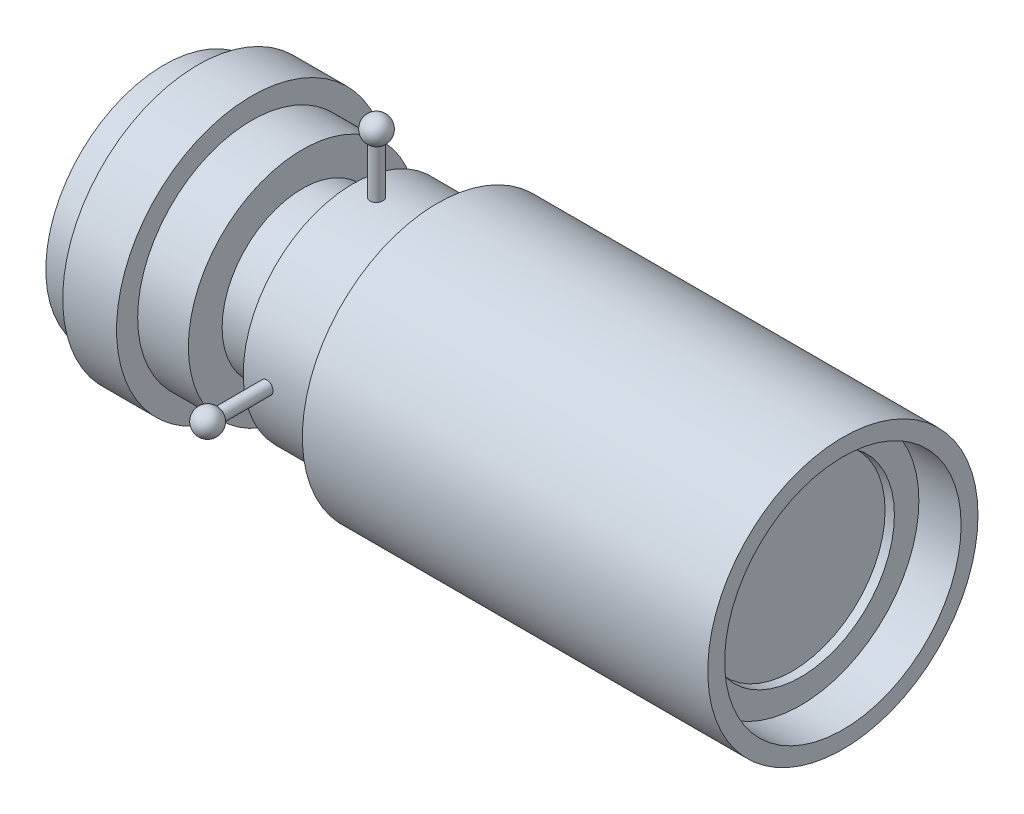
ISO-10303-21;
HEADER;
FILE_DESCRIPTION(('STEP AP214'),'2;1');
FILE_NAME('part.step','',(''),(''),'','','');
FILE_SCHEMA(('AUTOMOTIVE_DESIGN { 1 0 10303 214 1 1 1 1 }'));
ENDSEC;
DATA;
#1=APPLICATION_CONTEXT('core data for automotive mechanical design processes');
#2=APPLICATION_PROTOCOL_DEFINITION('international standard','automotive_design',2000,#1);
#3=PRODUCT_CONTEXT('',#1,'mechanical');
#4=PRODUCT('Part','Part','',(#3));
#5=PRODUCT_RELATED_PRODUCT_CATEGORY('part','',(#4));
#6=PRODUCT_DEFINITION_FORMATION('','',#4);
#7=PRODUCT_DEFINITION_CONTEXT('part definition',#1,'design');
#8=PRODUCT_DEFINITION('design','',#6,#7);
#9=PRODUCT_DEFINITION_SHAPE('','',#8);
#10=(LENGTH_UNIT() NAMED_UNIT(*) SI_UNIT(.MILLI.,.METRE.));
#11=(NAMED_UNIT(*) PLANE_ANGLE_UNIT() SI_UNIT($,.RADIAN.));
#12=(NAMED_UNIT(*) SI_UNIT($,.STERADIAN.) SOLID_ANGLE_UNIT());
#13=UNCERTAINTY_MEASURE_WITH_UNIT(LENGTH_MEASURE(1.E-05),#10,'distance_accuracy_value','');
#14=(GEOMETRIC_REPRESENTATION_CONTEXT(3) GLOBAL_UNCERTAINTY_ASSIGNED_CONTEXT((#13)) GLOBAL_UNIT_ASSIGNED_CONTEXT((#10,
#11,#12)) REPRESENTATION_CONTEXT('',''));
#15=CARTESIAN_POINT('',(0.,0.,0.));
#16=DIRECTION('',(0.,0.,1.));
#17=DIRECTION('',(1.,0.,0.));
#18=AXIS2_PLACEMENT_3D('',#15,#16,#17);
#19=CARTESIAN_POINT('',(-78.0171483417485,59.1215627402625,107.583431876308));
#20=DIRECTION('',(-1.,0.,0.));
#21=DIRECTION('',(0.,0.,1.));
#22=AXIS2_PLACEMENT_3D('',#19,#20,#21);
#23=PLANE('',#22);
#24=CARTESIAN_POINT('',(-78.0171483417485,59.1215627402625,107.583431876308));
#25=DIRECTION('',(1.,0.,0.));
#26=DIRECTION('',(0.,0.,-1.));
#27=AXIS2_PLACEMENT_3D('',#24,#25,#26);
#28=CIRCLE('',#27,44.45);
#29=CARTESIAN_POINT('',(-78.0171483417485,59.1215627402625,63.1334318763079));
#30=VERTEX_POINT('',#29);
#31=EDGE_CURVE('E47',#30,#30,#28,.T.);
#32=ORIENTED_EDGE('',*,*,#31,.F.);
#33=EDGE_LOOP('',(#32));
#34=FACE_BOUND('',#33,.T.);
#35=CARTESIAN_POINT('',(-78.0171483417485,59.1215627402625,107.583431876308));
#36=DIRECTION('',(1.,0.,0.));
#37=DIRECTION('',(0.,0.,-1.));
#38=AXIS2_PLACEMENT_3D('',#35,#36,#37);
#39=CIRCLE('',#38,32.5501);
#40=CARTESIAN_POINT('',(-78.0171483417485,59.1215627402625,75.0333318763079));
#41=VERTEX_POINT('',#40);
#42=EDGE_CURVE('E278',#41,#41,#39,.T.);
#43=ORIENTED_EDGE('',*,*,#42,.T.);
#44=EDGE_LOOP('',(#43));
#45=FACE_BOUND('',#44,.T.);
#46=ADVANCED_FACE('F13',(#34,#45),#23,.T.);
#47=CARTESIAN_POINT('',(177.170301658252,109.921562740263,107.583431876308));
#48=DIRECTION('',(1.,0.,0.));
#49=DIRECTION('',(0.,0.,-1.));
#50=AXIS2_PLACEMENT_3D('',#47,#48,#49);
#51=PLANE('',#50);
#52=CARTESIAN_POINT('',(177.170301658252,59.1215627402625,107.583431876308));
#53=DIRECTION('',(1.,0.,0.));
#54=DIRECTION('',(0.,0.,-1.));
#55=AXIS2_PLACEMENT_3D('',#52,#53,#54);
#56=CIRCLE('',#55,50.8);
#57=CARTESIAN_POINT('',(177.170301658252,59.1215627402625,56.7834318763079));
#58=VERTEX_POINT('',#57);
#59=EDGE_CURVE('E29',#58,#58,#56,.T.);
#60=ORIENTED_EDGE('',*,*,#59,.T.);
#61=EDGE_LOOP('',(#60));
#62=FACE_BOUND('',#61,.T.);
#63=CARTESIAN_POINT('',(177.170301658252,59.1215627402625,107.583431876308));
#64=DIRECTION('',(1.,0.,0.));
#65=DIRECTION('',(0.,0.,-1.));
#66=AXIS2_PLACEMENT_3D('',#63,#64,#65);
#67=CIRCLE('',#66,44.45);
#68=CARTESIAN_POINT('',(177.170301658252,59.1215627402625,63.1334318763079));
#69=VERTEX_POINT('',#68);
#70=EDGE_CURVE('E200',#69,#69,#67,.T.);
#71=ORIENTED_EDGE('',*,*,#70,.F.);
#72=EDGE_LOOP('',(#71));
#73=FACE_BOUND('',#72,.T.);
#74=ADVANCED_FACE('F15',(#62,#73),#51,.T.);
#75=CARTESIAN_POINT('',(24.7703016582515,94.3767627402625,107.583431876308));
#76=DIRECTION('',(-1.,0.,0.));
#77=DIRECTION('',(0.,0.,1.));
#78=AXIS2_PLACEMENT_3D('',#75,#76,#77);
#79=PLANE('',#78);
#80=CARTESIAN_POINT('',(24.7703016582515,59.1215627402625,107.583431876308));
#81=DIRECTION('',(1.,0.,0.));
#82=DIRECTION('',(0.,0.,-1.));
#83=AXIS2_PLACEMENT_3D('',#80,#81,#82);
#84=CIRCLE('',#83,50.8);
#85=CARTESIAN_POINT('',(24.7703016582515,59.1215627402625,56.7834318763079));
#86=VERTEX_POINT('',#85);
#87=EDGE_CURVE('E22',#86,#86,#84,.T.);
#88=ORIENTED_EDGE('',*,*,#87,.F.);
#89=EDGE_LOOP('',(#88));
#90=FACE_BOUND('',#89,.T.);
#91=CARTESIAN_POINT('',(24.7703016582515,59.1215627402625,107.583431876308));
#92=DIRECTION('',(-1.,0.,0.));
#93=DIRECTION('',(0.,0.,1.));
#94=AXIS2_PLACEMENT_3D('',#91,#92,#93);
#95=CIRCLE('',#94,41.275);
#96=CARTESIAN_POINT('',(24.7703016582515,59.1215627402625,148.858431876308));
#97=VERTEX_POINT('',#96);
#98=EDGE_CURVE('E242',#97,#97,#95,.T.);
#99=ORIENTED_EDGE('',*,*,#98,.F.);
#100=EDGE_LOOP('',(#99));
#101=FACE_BOUND('',#100,.T.);
#102=ADVANCED_FACE('F147',(#90,#101),#79,.T.);
#103=CARTESIAN_POINT('',(177.170301658252,59.1215627402625,107.583431876308));
#104=DIRECTION('',(1.,0.,0.));
#105=DIRECTION('',(0.,0.,-1.));
#106=AXIS2_PLACEMENT_3D('',#103,#104,#105);
#107=CYLINDRICAL_SURFACE('',#106,50.8);
#108=ORIENTED_EDGE('',*,*,#87,.T.);
#109=EDGE_LOOP('',(#108));
#110=FACE_BOUND('',#109,.T.);
#111=ORIENTED_EDGE('',*,*,#59,.F.);
#112=EDGE_LOOP('',(#111));
#113=FACE_BOUND('',#112,.T.);
#114=ADVANCED_FACE('F137',(#110,#113),#107,.T.);
#115=CARTESIAN_POINT('',(-45.0796983417485,59.1215627402625,107.583431876308));
#116=DIRECTION('',(-1.,0.,0.));
#117=DIRECTION('',(0.,0.,1.));
#118=AXIS2_PLACEMENT_3D('',#115,#116,#117);
#119=CYLINDRICAL_SURFACE('',#118,41.275);
#120=CARTESIAN_POINT('',(4.23289890072671,100.396562740263,107.583431876307));
#121=CARTESIAN_POINT('',(4.23289299780843,100.396561819881,107.717424198853));
#122=CARTESIAN_POINT('',(4.22158151443307,100.395903283161,107.85151082114));
#123=CARTESIAN_POINT('',(4.17661934903501,100.393339559722,108.115983008283));
#124=CARTESIAN_POINT('',(4.14294253875862,100.39143291494,108.246364058113));
#125=CARTESIAN_POINT('',(4.05421900539376,100.386588710888,108.499555832176));
#126=CARTESIAN_POINT('',(3.99918340308884,100.383651688177,108.622370457488));
#127=CARTESIAN_POINT('',(3.86932220294319,100.377077238978,108.856985763426));
#128=CARTESIAN_POINT('',(3.79450119281907,100.37343997491,108.96878898907));
#129=CARTESIAN_POINT('',(3.62708563944906,100.365868715182,109.178386142113));
#130=CARTESIAN_POINT('',(3.53447081559785,100.361934384073,109.276163859595));
#131=CARTESIAN_POINT('',(3.33413801652064,100.354215286754,109.454795981656));
#132=CARTESIAN_POINT('',(3.22641941619124,100.350430526742,109.535649685453));
#133=CARTESIAN_POINT('',(2.99884715056514,100.343434857868,109.678186923284));
#134=CARTESIAN_POINT('',(2.87898519838171,100.340224345073,109.739857247744));
#135=CARTESIAN_POINT('',(2.63058684805583,100.334743479808,109.842192541279));
#136=CARTESIAN_POINT('',(2.50205053225712,100.332473118415,109.882857709718));
#137=CARTESIAN_POINT('',(2.24010608885022,100.329131727286,109.941984049703));
#138=CARTESIAN_POINT('',(2.10670363005134,100.328059345312,109.960470257842));
#139=CARTESIAN_POINT('',(1.83868509780719,100.327230791935,109.974791194611));
#140=CARTESIAN_POINT('',(1.70406903645938,100.327474607425,109.970626148785));
#141=CARTESIAN_POINT('',(1.43761498352795,100.329249698096,109.939783611391));
#142=CARTESIAN_POINT('',(1.30577384617899,100.330779424863,109.913133195155));
#143=CARTESIAN_POINT('',(1.04843961837524,100.334951499081,109.838118405809));
#144=CARTESIAN_POINT('',(0.922946561504216,100.337593852419,109.789753917837));
#145=CARTESIAN_POINT('',(0.681783696174177,100.343695171115,109.672653064286));
#146=CARTESIAN_POINT('',(0.566119876472209,100.347154629537,109.603904391916));
#147=CARTESIAN_POINT('',(0.347964238935068,100.354499780539,109.447995627094));
#148=CARTESIAN_POINT('',(0.24547254725768,100.358385477202,109.360835358325));
#149=CARTESIAN_POINT('',(0.0564129773318895,100.366152065514,109.170424949797));
#150=CARTESIAN_POINT('',(-0.0301312983034777,100.370032941731,109.067151372493));
#151=CARTESIAN_POINT('',(-0.184657377509493,100.377347026096,108.847528149635));
#152=CARTESIAN_POINT('',(-0.25263917542123,100.380780234108,108.731178500097));
#153=CARTESIAN_POINT('',(-0.368108443093572,100.386812310973,108.488691757557));
#154=CARTESIAN_POINT('',(-0.415595046896915,100.389411144571,108.362554251268));
#155=CARTESIAN_POINT('',(-0.488710324764417,100.393481116171,108.104078661509));
#156=CARTESIAN_POINT('',(-0.514339217589914,100.394952265459,107.971740640111));
#157=CARTESIAN_POINT('',(-0.542982379367461,100.396599630025,107.704825440864));
#158=CARTESIAN_POINT('',(-0.546029286692625,100.396777714198,107.57025177652));
#159=CARTESIAN_POINT('',(-0.529507224691486,100.39582384733,107.302505274379));
#160=CARTESIAN_POINT('',(-0.509938355952366,100.394691902116,107.169332430354));
#161=CARTESIAN_POINT('',(-0.448767250375907,100.391246633961,106.908259606731));
#162=CARTESIAN_POINT('',(-0.407179959451332,100.388934112422,106.780356113742));
#163=CARTESIAN_POINT('',(-0.30316768825478,100.383387933989,106.533344345062));
#164=CARTESIAN_POINT('',(-0.240742547304242,100.380154269992,106.414236137198));
#165=CARTESIAN_POINT('',(-0.0967433206178364,100.373124664792,106.188046359921));
#166=CARTESIAN_POINT('',(-0.0151474044639895,100.369328084409,106.080978708567));
#167=CARTESIAN_POINT('',(0.164845341297011,100.361602172478,105.88204934465));
#168=CARTESIAN_POINT('',(0.263242313299683,100.357672839803,105.790187760979));
#169=CARTESIAN_POINT('',(0.474184695077236,100.350118908938,105.624167852857));
#170=CARTESIAN_POINT('',(0.586746766865326,100.346494678148,105.550030679919));
#171=CARTESIAN_POINT('',(0.822740207874764,100.339965472831,105.421708707882));
#172=CARTESIAN_POINT('',(0.946171517881797,100.337060494384,105.367523800093));
#173=CARTESIAN_POINT('',(1.20032197656275,100.332300027223,105.280681198396));
#174=CARTESIAN_POINT('',(1.33103654033861,100.330443886271,105.248010123676));
#175=CARTESIAN_POINT('',(1.59610687349027,100.327988592356,105.205078874241));
#176=CARTESIAN_POINT('',(1.73046261289071,100.327389429048,105.194818515091));
#177=CARTESIAN_POINT('',(1.99879104024656,100.327515908479,105.197001698125));
#178=CARTESIAN_POINT('',(2.13276400100456,100.328239610415,105.209411979736));
#179=CARTESIAN_POINT('',(2.39672065711518,100.330926154407,105.256515283018));
#180=CARTESIAN_POINT('',(2.52670434507817,100.332888998759,105.291208345962));
#181=CARTESIAN_POINT('',(2.77899840824806,100.337832158006,105.381885159474));
#182=CARTESIAN_POINT('',(2.90130878876675,100.340812472197,105.437868895303));
#183=CARTESIAN_POINT('',(3.13479783885741,100.347454627737,105.569532946636));
#184=CARTESIAN_POINT('',(3.24597681779542,100.351116450137,105.645212714533));
#185=CARTESIAN_POINT('',(3.45421500874772,100.358715167345,105.814242390613));
#186=CARTESIAN_POINT('',(3.55125489870756,100.362652427889,105.907616085498));
#187=CARTESIAN_POINT('',(3.72831453461654,100.370355355403,106.10935597607));
#188=CARTESIAN_POINT('',(3.80833010147093,100.374120980061,106.217725842236));
#189=CARTESIAN_POINT('',(3.94912003962222,100.381059697684,106.446489887237));
#190=CARTESIAN_POINT('',(4.00987265678993,100.384232119082,106.56689746022));
#191=CARTESIAN_POINT('',(4.11022577613303,100.389617585143,106.816133546145));
#192=CARTESIAN_POINT('',(4.14985113521927,100.391831756637,106.944951962177));
#193=CARTESIAN_POINT('',(4.19648815920124,100.394468845125,107.1593748122));
#194=CARTESIAN_POINT('',(4.21012462081479,100.395250581644,107.243592075818));
#195=CARTESIAN_POINT('',(4.22833186371869,100.39629782164,107.413004133736));
#196=CARTESIAN_POINT('',(4.23290265559211,100.39656332572,107.498198926896));
#197=CARTESIAN_POINT('',(4.23289890072671,100.396562740263,107.583431876307));
#198=B_SPLINE_CURVE_WITH_KNOTS('',3,(#120,#121,#122,#123,#124,#125,#126,#127,#128,#129,#130,
#131,#132,#133,#134,#135,#136,#137,#138,#139,#140,#141,#142,#143,#144,#145,#146,#147,#148,#149,
#150,#151,#152,#153,#154,#155,#156,#157,#158,#159,#160,#161,#162,#163,#164,#165,#166,#167,#168,
#169,#170,#171,#172,#173,#174,#175,#176,#177,#178,#179,#180,#181,#182,#183,#184,#185,#186,#187,
#188,#189,#190,#191,#192,#193,#194,#195,#196,#197),.UNSPECIFIED.,.T.,.F.,(4,2,2,2,2,2,2,2,2,2,2,
2,2,2,2,2,2,2,2,2,2,2,2,2,2,2,2,2,2,2,2,2,2,2,2,2,2,2,4),(0.,0.401665824304537,
0.803801721395143,1.20572852054412,1.60756220501651,2.00985662831124,2.41216770637324,
2.814755203592,3.21733887967799,3.61946767255596,4.02159246134957,4.42323372914227,
4.8248771215474,5.2267634984674,5.62865372422012,6.03113406311283,6.43361452470456,
6.83611199012489,7.23860542713083,7.64051701549831,8.04242681630834,8.4440641533606,
8.84570458746943,9.24780461917807,9.64990805901092,10.0524889821852,10.4550677122823,
10.8573958161251,11.2597206088744,11.6614556164529,12.0631913681494,12.4649268417439,
12.8666511471279,13.2689193889994,13.6712862651844,14.0741059390714,14.4764506307366,
14.7319518579585,14.9874527869134),.UNSPECIFIED.);
#199=CARTESIAN_POINT('',(4.23289890072671,100.396562740263,107.583431876307));
#200=VERTEX_POINT('',#199);
#201=EDGE_CURVE('E52',#200,#200,#198,.T.);
#202=ORIENTED_EDGE('',*,*,#201,.T.);
#203=EDGE_LOOP('',(#202));
#204=FACE_BOUND('',#203,.T.);
#205=CARTESIAN_POINT('',(4.23289890072671,59.1215627402625,148.858431876308));
#206=CARTESIAN_POINT('',(4.23289299780843,58.9875704177169,148.858430955926));
#207=CARTESIAN_POINT('',(4.22158151443307,58.8534837954303,148.857772419207));
#208=CARTESIAN_POINT('',(4.17661934903501,58.5890116082874,148.855208695767));
#209=CARTESIAN_POINT('',(4.14294253875862,58.4586305584566,148.853302050985));
#210=CARTESIAN_POINT('',(4.05421900539376,58.2054387843936,148.848457846933));
#211=CARTESIAN_POINT('',(3.99918340308884,58.0826241590823,148.845520824222));
#212=CARTESIAN_POINT('',(3.86932220294319,57.848008853144,148.838946375023));
#213=CARTESIAN_POINT('',(3.79450119281907,57.7362056275,148.835309110956));
#214=CARTESIAN_POINT('',(3.62708563944906,57.5266084744569,148.827737851228));
#215=CARTESIAN_POINT('',(3.53447081559785,57.4288307569753,148.823803520119));
#216=CARTESIAN_POINT('',(3.33413801652064,57.2501986349136,148.816084422799));
#217=CARTESIAN_POINT('',(3.22641941619123,57.1693449311168,148.812299662788));
#218=CARTESIAN_POINT('',(2.99884715056514,57.0268076932859,148.805303993914));
#219=CARTESIAN_POINT('',(2.87898519838171,56.9651373688258,148.802093481119));
#220=CARTESIAN_POINT('',(2.63058684805583,56.8628020752914,148.796612615854));
#221=CARTESIAN_POINT('',(2.50205053225712,56.8221369068516,148.794342254461));
#222=CARTESIAN_POINT('',(2.24010608885022,56.7630105668672,148.791000863331));
#223=CARTESIAN_POINT('',(2.10670363005134,56.7445243587276,148.789928481357));
#224=CARTESIAN_POINT('',(1.83868509780719,56.7302034219586,148.78909992798));
#225=CARTESIAN_POINT('',(1.70406903645938,56.7343684677853,148.789343743471));
#226=CARTESIAN_POINT('',(1.43761498352795,56.765211005179,148.791118834142));
#227=CARTESIAN_POINT('',(1.30577384617899,56.7918614214149,148.792648560908));
#228=CARTESIAN_POINT('',(1.04843961837524,56.8668762107608,148.796820635126));
#229=CARTESIAN_POINT('',(0.922946561504217,56.9152406987331,148.799462988464));
#230=CARTESIAN_POINT('',(0.681783696174176,57.0323415522844,148.80556430716));
#231=CARTESIAN_POINT('',(0.566119876472208,57.1010902246544,148.809023765582));
#232=CARTESIAN_POINT('',(0.347964238935067,57.2569989894755,148.816368916585));
#233=CARTESIAN_POINT('',(0.245472547257681,57.3441592582449,148.820254613247));
#234=CARTESIAN_POINT('',(0.0564129773318909,57.5345696667726,148.828021201559));
#235=CARTESIAN_POINT('',(-0.0301312983034765,57.6378432440773,148.831902077776));
#236=CARTESIAN_POINT('',(-0.184657377509492,57.8574664669346,148.839216162141));
#237=CARTESIAN_POINT('',(-0.252639175421228,57.9738161164734,148.842649370153));
#238=CARTESIAN_POINT('',(-0.368108443093571,58.2163028590131,148.848681447018));
#239=CARTESIAN_POINT('',(-0.415595046896915,58.3424403653023,148.851280280616));
#240=CARTESIAN_POINT('',(-0.488710324764419,58.6009159550608,148.855350252217));
#241=CARTESIAN_POINT('',(-0.514339217589914,58.7332539764587,148.856821401505));
#242=CARTESIAN_POINT('',(-0.54298237936746,59.0001691757062,148.85846876607));
#243=CARTESIAN_POINT('',(-0.546029286692624,59.1347428400497,148.858646850243));
#244=CARTESIAN_POINT('',(-0.529507224691484,59.4024893421908,148.857692983376));
#245=CARTESIAN_POINT('',(-0.509938355952365,59.5356621862161,148.856561038162));
#246=CARTESIAN_POINT('',(-0.448767250375909,59.7967350098392,148.853115770006));
#247=CARTESIAN_POINT('',(-0.407179959451335,59.9246385028277,148.850803248468));
#248=CARTESIAN_POINT('',(-0.303167688254783,60.1716502715081,148.845257070035));
#249=CARTESIAN_POINT('',(-0.240742547304242,60.2907584793717,148.842023406037));
#250=CARTESIAN_POINT('',(-0.0967433206178337,60.5169482566489,148.834993800837));
#251=CARTESIAN_POINT('',(-0.0151474044639862,60.6240159080034,148.831197220455));
#252=CARTESIAN_POINT('',(0.164845341297016,60.8229452719195,148.823471308523));
#253=CARTESIAN_POINT('',(0.263242313299688,60.9148068555907,148.819541975849));
#254=CARTESIAN_POINT('',(0.474184695077237,61.080826763713,148.811988044983));
#255=CARTESIAN_POINT('',(0.586746766865325,61.1549639366506,148.808363814194));
#256=CARTESIAN_POINT('',(0.822740207874762,61.2832859086882,148.801834608876));
#257=CARTESIAN_POINT('',(0.946171517881796,61.3374708164774,148.798929630429));
#258=CARTESIAN_POINT('',(1.20032197656275,61.4243134181739,148.794169163268));
#259=CARTESIAN_POINT('',(1.33103654033861,61.4569844928939,148.792313022317));
#260=CARTESIAN_POINT('',(1.59610687349028,61.4999157423286,148.789857728402));
#261=CARTESIAN_POINT('',(1.73046261289071,61.5101761014791,148.789258565093));
#262=CARTESIAN_POINT('',(1.99879104024656,61.5079929184452,148.789385044524));
#263=CARTESIAN_POINT('',(2.13276400100456,61.4955826368343,148.79010874646));
#264=CARTESIAN_POINT('',(2.39672065711518,61.4484793335524,148.792795290453));
#265=CARTESIAN_POINT('',(2.52670434507817,61.4137862706082,148.794758134804));
#266=CARTESIAN_POINT('',(2.77899840824806,61.3231094570964,148.799701294051));
#267=CARTESIAN_POINT('',(2.90130878876675,61.2671257212673,148.802681608242));
#268=CARTESIAN_POINT('',(3.13479783885741,61.1354616699342,148.809323763782));
#269=CARTESIAN_POINT('',(3.24597681779542,61.0597819020366,148.812985586183));
#270=CARTESIAN_POINT('',(3.45421500874772,60.8907522259569,148.820584303391));
#271=CARTESIAN_POINT('',(3.55125489870756,60.7973785310724,148.824521563935));
#272=CARTESIAN_POINT('',(3.72831453461653,60.5956386405002,148.832224491448));
#273=CARTESIAN_POINT('',(3.80833010147093,60.4872687743342,148.835990116107));
#274=CARTESIAN_POINT('',(3.94912003962222,60.2585047293329,148.842928833729));
#275=CARTESIAN_POINT('',(4.00987265678992,60.13809715635,148.846101255128));
#276=CARTESIAN_POINT('',(4.11022577613302,59.8888610704253,148.851486721188));
#277=CARTESIAN_POINT('',(4.14985113521926,59.7600426543928,148.853700892682));
#278=CARTESIAN_POINT('',(4.19648815920124,59.5456198043699,148.85633798117));
#279=CARTESIAN_POINT('',(4.21012462081479,59.4614025407523,148.85711971769));
#280=CARTESIAN_POINT('',(4.22833186371869,59.2919904828337,148.858166957686));
#281=CARTESIAN_POINT('',(4.23290265559211,59.2067956896739,148.858432461766));
#282=CARTESIAN_POINT('',(4.23289890072671,59.1215627402625,148.858431876308));
#283=B_SPLINE_CURVE_WITH_KNOTS('',3,(#205,#206,#207,#208,#209,#210,#211,#212,#213,#214,#215,
#216,#217,#218,#219,#220,#221,#222,#223,#224,#225,#226,#227,#228,#229,#230,#231,#232,#233,#234,
#235,#236,#237,#238,#239,#240,#241,#242,#243,#244,#245,#246,#247,#248,#249,#250,#251,#252,#253,
#254,#255,#256,#257,#258,#259,#260,#261,#262,#263,#264,#265,#266,#267,#268,#269,#270,#271,#272,
#273,#274,#275,#276,#277,#278,#279,#280,#281,#282),.UNSPECIFIED.,.T.,.F.,(4,2,2,2,2,2,2,2,2,2,2,
2,2,2,2,2,2,2,2,2,2,2,2,2,2,2,2,2,2,2,2,2,2,2,2,2,2,2,4),(0.,0.401665824304551,
0.803801721395143,1.20572852054413,1.60756220501652,2.00985662831124,2.41216770637324,
2.81475520359201,3.21733887967799,3.61946767255597,4.02159246134957,4.42323372914227,
4.8248771215474,5.2267634984674,5.62865372422012,6.03113406311282,6.43361452470457,
6.83611199012488,7.23860542713085,7.64051701549833,8.04242681630835,8.44406415336059,
8.84570458746943,9.24780461917809,9.64990805901092,10.0524889821852,10.4550677122823,
10.8573958161251,11.2597206088744,11.6614556164529,12.0631913681494,12.4649268417439,
12.8666511471279,13.2689193889994,13.6712862651844,14.0741059390713,14.4764506307366,
14.7319518579585,14.9874527869134),.UNSPECIFIED.);
#284=CARTESIAN_POINT('',(4.23289890072671,59.1215627402625,148.858431876308));
#285=VERTEX_POINT('',#284);
#286=EDGE_CURVE('E62',#285,#285,#283,.T.);
#287=ORIENTED_EDGE('',*,*,#286,.T.);
#288=EDGE_LOOP('',(#287));
#289=FACE_BOUND('',#288,.T.);
#290=CARTESIAN_POINT('',(4.23289890072671,17.8465627402625,107.583431876308));
#291=CARTESIAN_POINT('',(4.23289299780843,17.8465636606441,107.449439553762));
#292=CARTESIAN_POINT('',(4.22158151443307,17.8472221973637,107.315352931476));
#293=CARTESIAN_POINT('',(4.17661934903501,17.8497859208029,107.050880744333));
#294=CARTESIAN_POINT('',(4.14294253875862,17.8516925655853,106.920499694502));
#295=CARTESIAN_POINT('',(4.05421900539376,17.8565367696371,106.667307920439));
#296=CARTESIAN_POINT('',(3.99918340308884,17.8594737923482,106.544493295128));
#297=CARTESIAN_POINT('',(3.86932220294319,17.8660482415473,106.30987798919));
#298=CARTESIAN_POINT('',(3.79450119281908,17.8696855056146,106.198074763546));
#299=CARTESIAN_POINT('',(3.62708563944906,17.8772567653428,105.988477610502));
#300=CARTESIAN_POINT('',(3.53447081559785,17.8811910964516,105.890699893021));
#301=CARTESIAN_POINT('',(3.33413801652064,17.8889101937709,105.712067770959));
#302=CARTESIAN_POINT('',(3.22641941619124,17.8926949537827,105.631214067162));
#303=CARTESIAN_POINT('',(2.99884715056514,17.8996906226567,105.488676829331));
#304=CARTESIAN_POINT('',(2.8789851983817,17.9029011354517,105.427006504871));
#305=CARTESIAN_POINT('',(2.63058684805583,17.9083820007166,105.324671211337));
#306=CARTESIAN_POINT('',(2.50205053225712,17.9106523621098,105.284006042897));
#307=CARTESIAN_POINT('',(2.24010608885022,17.913993753239,105.224879702913));
#308=CARTESIAN_POINT('',(2.10670363005134,17.915066135213,105.206393494773));
#309=CARTESIAN_POINT('',(1.83868509780719,17.9158946885904,105.192072558004));
#310=CARTESIAN_POINT('',(1.70406903645938,17.9156508730996,105.196237603831));
#311=CARTESIAN_POINT('',(1.43761498352795,17.9138757824287,105.227080141225));
#312=CARTESIAN_POINT('',(1.30577384617899,17.9123460556624,105.25373055746));
#313=CARTESIAN_POINT('',(1.04843961837524,17.9081739814439,105.328745346806));
#314=CARTESIAN_POINT('',(0.922946561504217,17.9055316281062,105.377109834779));
#315=CARTESIAN_POINT('',(0.681783696174175,17.89943030941,105.49421068833));
#316=CARTESIAN_POINT('',(0.566119876472204,17.8959708509881,105.5629593607));
#317=CARTESIAN_POINT('',(0.347964238935064,17.8886256999857,105.718868125521));
#318=CARTESIAN_POINT('',(0.245472547257679,17.8847400033235,105.80602839429));
#319=CARTESIAN_POINT('',(0.0564129773318934,17.876973415011,105.996438802818));
#320=CARTESIAN_POINT('',(-0.0301312983034722,17.873092538794,106.099712380123));
#321=CARTESIAN_POINT('',(-0.184657377509489,17.8657784544289,106.31933560298));
#322=CARTESIAN_POINT('',(-0.252639175421228,17.8623452464174,106.435685252519));
#323=CARTESIAN_POINT('',(-0.368108443093572,17.8563131695525,106.678171995059));
#324=CARTESIAN_POINT('',(-0.415595046896915,17.853714335954,106.804309501348));
#325=CARTESIAN_POINT('',(-0.488710324764417,17.8496443643539,107.062785091106));
#326=CARTESIAN_POINT('',(-0.514339217589914,17.8481732150658,107.195123112504));
#327=CARTESIAN_POINT('',(-0.54298237936746,17.8465258505002,107.462038311752));
#328=CARTESIAN_POINT('',(-0.546029286692624,17.8463477663273,107.596611976095));
#329=CARTESIAN_POINT('',(-0.529507224691486,17.8473016331947,107.864358478236));
#330=CARTESIAN_POINT('',(-0.509938355952366,17.8484335784087,107.997531322262));
#331=CARTESIAN_POINT('',(-0.448767250375909,17.851878846564,108.258604145885));
#332=CARTESIAN_POINT('',(-0.407179959451336,17.8541913681026,108.386507638873));
#333=CARTESIAN_POINT('',(-0.303167688254785,17.8597375465359,108.633519407554));
#334=CARTESIAN_POINT('',(-0.240742547304244,17.8629712105334,108.752627615417));
#335=CARTESIAN_POINT('',(-0.0967433206178346,17.8700008157332,108.978817392694));
#336=CARTESIAN_POINT('',(-0.015147404463987,17.8737973961156,109.085885044049));
#337=CARTESIAN_POINT('',(0.164845341297015,17.8815233080473,109.284814407965));
#338=CARTESIAN_POINT('',(0.263242313299687,17.8854526407216,109.376675991636));
#339=CARTESIAN_POINT('',(0.474184695077239,17.8930065715871,109.542695899759));
#340=CARTESIAN_POINT('',(0.586746766865329,17.8966308023765,109.616833072696));
#341=CARTESIAN_POINT('',(0.822740207874765,17.9031600076944,109.745155044734));
#342=CARTESIAN_POINT('',(0.946171517881797,17.9060649861409,109.799339952523));
#343=CARTESIAN_POINT('',(1.20032197656275,17.9108254533025,109.886182554219));
#344=CARTESIAN_POINT('',(1.33103654033861,17.9126815942538,109.918853628939));
#345=CARTESIAN_POINT('',(1.59610687349028,17.9151368881687,109.961784878374));
#346=CARTESIAN_POINT('',(1.73046261289071,17.915736051477,109.972045237525));
#347=CARTESIAN_POINT('',(1.99879104024655,17.9156095720465,109.969862054491));
#348=CARTESIAN_POINT('',(2.13276400100456,17.9148858701101,109.95745177288));
#349=CARTESIAN_POINT('',(2.39672065711518,17.9121993261176,109.910348469598));
#350=CARTESIAN_POINT('',(2.52670434507817,17.9102364817663,109.875655406654));
#351=CARTESIAN_POINT('',(2.77899840824806,17.9052933225194,109.784978593142));
#352=CARTESIAN_POINT('',(2.90130878876675,17.9023130083281,109.728994857313));
#353=CARTESIAN_POINT('',(3.1347978388574,17.895670852788,109.59733080598));
#354=CARTESIAN_POINT('',(3.24597681779542,17.8920090303879,109.521651038082));
#355=CARTESIAN_POINT('',(3.45421500874772,17.8844103131798,109.352621362002));
#356=CARTESIAN_POINT('',(3.55125489870756,17.8804730526358,109.259247667118));
#357=CARTESIAN_POINT('',(3.72831453461654,17.8727701251224,109.057507776546));
#358=CARTESIAN_POINT('',(3.80833010147093,17.8690045004636,108.94913791038));
#359=CARTESIAN_POINT('',(3.94912003962222,17.8620657828409,108.720373865378));
#360=CARTESIAN_POINT('',(4.00987265678992,17.8588933614427,108.599966292395));
#361=CARTESIAN_POINT('',(4.11022577613302,17.8535078953823,108.350730206471));
#362=CARTESIAN_POINT('',(4.14985113521926,17.8512937238881,108.221911790438));
#363=CARTESIAN_POINT('',(4.19648815920124,17.8486566353999,108.007488940415));
#364=CARTESIAN_POINT('',(4.21012462081479,17.8478748988808,107.923271676798));
#365=CARTESIAN_POINT('',(4.22833186371869,17.8468276588846,107.753859618879));
#366=CARTESIAN_POINT('',(4.23290265559211,17.8465621548048,107.668664825719));
#367=CARTESIAN_POINT('',(4.23289890072671,17.8465627402625,107.583431876308));
#368=B_SPLINE_CURVE_WITH_KNOTS('',3,(#290,#291,#292,#293,#294,#295,#296,#297,#298,#299,#300,
#301,#302,#303,#304,#305,#306,#307,#308,#309,#310,#311,#312,#313,#314,#315,#316,#317,#318,#319,
#320,#321,#322,#323,#324,#325,#326,#327,#328,#329,#330,#331,#332,#333,#334,#335,#336,#337,#338,
#339,#340,#341,#342,#343,#344,#345,#346,#347,#348,#349,#350,#351,#352,#353,#354,#355,#356,#357,
#358,#359,#360,#361,#362,#363,#364,#365,#366,#367),.UNSPECIFIED.,.T.,.F.,(4,2,2,2,2,2,2,2,2,2,2,
2,2,2,2,2,2,2,2,2,2,2,2,2,2,2,2,2,2,2,2,2,2,2,2,2,2,2,4),(0.,0.401665824304551,
0.803801721395129,1.20572852054411,1.60756220501651,2.00985662831122,2.41216770637324,
2.81475520359201,3.21733887967798,3.61946767255596,4.02159246134957,4.42323372914226,
4.8248771215474,5.2267634984674,5.62865372422011,6.03113406311281,6.43361452470456,
6.83611199012489,7.23860542713084,7.64051701549831,8.04242681630834,8.44406415336058,
8.84570458746943,9.24780461917808,9.64990805901091,10.0524889821852,10.4550677122823,
10.8573958161251,11.2597206088744,11.6614556164529,12.0631913681494,12.4649268417439,
12.8666511471279,13.2689193889994,13.6712862651844,14.0741059390714,14.4764506307366,
14.7319518579585,14.9874527869134),.UNSPECIFIED.);
#369=CARTESIAN_POINT('',(4.23289890072671,17.8465627402625,107.583431876308));
#370=VERTEX_POINT('',#369);
#371=EDGE_CURVE('E98',#370,#370,#368,.T.);
#372=ORIENTED_EDGE('',*,*,#371,.T.);
#373=EDGE_LOOP('',(#372));
#374=FACE_BOUND('',#373,.T.);
#375=CARTESIAN_POINT('',(4.23289890072671,59.1215627402625,66.3084318763079));
#376=CARTESIAN_POINT('',(4.23289299780843,59.2555550628082,66.3084327966894));
#377=CARTESIAN_POINT('',(4.22158151443307,59.3896416850947,66.309091333409));
#378=CARTESIAN_POINT('',(4.17661934903501,59.6541138722376,66.3116550568482));
#379=CARTESIAN_POINT('',(4.14294253875862,59.7844949220684,66.3135617016306));
#380=CARTESIAN_POINT('',(4.05421900539376,60.0376866961315,66.3184059056825));
#381=CARTESIAN_POINT('',(3.99918340308884,60.1605013214427,66.3213429283935));
#382=CARTESIAN_POINT('',(3.86932220294319,60.395116627381,66.3279173775927));
#383=CARTESIAN_POINT('',(3.79450119281907,60.506919853025,66.33155464166));
#384=CARTESIAN_POINT('',(3.62708563944906,60.7165170060681,66.3391259013882));
#385=CARTESIAN_POINT('',(3.53447081559786,60.8142947235497,66.343060232497));
#386=CARTESIAN_POINT('',(3.33413801652064,60.9929268456115,66.3507793298162));
#387=CARTESIAN_POINT('',(3.22641941619124,61.0737805494082,66.354564089828));
#388=CARTESIAN_POINT('',(2.99884715056514,61.2163177872392,66.3615597587021));
#389=CARTESIAN_POINT('',(2.87898519838171,61.2779881116993,66.364770271497));
#390=CARTESIAN_POINT('',(2.63058684805583,61.3803234052337,66.370251136762));
#391=CARTESIAN_POINT('',(2.50205053225712,61.4209885736734,66.3725214981552));
#392=CARTESIAN_POINT('',(2.24010608885022,61.4801149136579,66.3758628892844));
#393=CARTESIAN_POINT('',(2.10670363005134,61.4986011217974,66.3769352712584));
#394=CARTESIAN_POINT('',(1.83868509780719,61.5129220585664,66.3777638246358));
#395=CARTESIAN_POINT('',(1.70406903645938,61.5087570127397,66.3775200091449));
#396=CARTESIAN_POINT('',(1.43761498352795,61.477914475346,66.375744918474));
#397=CARTESIAN_POINT('',(1.30577384617899,61.4512640591101,66.3742151917077));
#398=CARTESIAN_POINT('',(1.04843961837524,61.3762492697643,66.3700431174892));
#399=CARTESIAN_POINT('',(0.922946561504217,61.327884781792,66.3674007641516));
#400=CARTESIAN_POINT('',(0.681783696174176,61.2107839282406,66.3612994454554));
#401=CARTESIAN_POINT('',(0.566119876472208,61.1420352558706,66.3578399870335));
#402=CARTESIAN_POINT('',(0.347964238935067,60.9861264910496,66.350494836031));
#403=CARTESIAN_POINT('',(0.24547254725768,60.8989662222802,66.3466091393688));
#404=CARTESIAN_POINT('',(0.0564129773318893,60.7085558137525,66.3388425510564));
#405=CARTESIAN_POINT('',(-0.030131298303479,60.6052822364477,66.3349616748393));
#406=CARTESIAN_POINT('',(-0.184657377509494,60.3856590135905,66.3276475904742));
#407=CARTESIAN_POINT('',(-0.252639175421229,60.2693093640517,66.3242143824627));
#408=CARTESIAN_POINT('',(-0.368108443093571,60.026822621512,66.3181823055978));
#409=CARTESIAN_POINT('',(-0.415595046896915,59.9006851152228,66.3155834719994));
#410=CARTESIAN_POINT('',(-0.488710324764418,59.6422095254643,66.3115135003992));
#411=CARTESIAN_POINT('',(-0.514339217589914,59.5098715040663,66.3100423511111));
#412=CARTESIAN_POINT('',(-0.54298237936746,59.2429563048189,66.3083949865456));
#413=CARTESIAN_POINT('',(-0.546029286692624,59.1083826404754,66.3082169023726));
#414=CARTESIAN_POINT('',(-0.529507224691485,58.8406361383343,66.3091707692401));
#415=CARTESIAN_POINT('',(-0.509938355952365,58.7074632943089,66.310302714454));
#416=CARTESIAN_POINT('',(-0.448767250375908,58.4463904706858,66.3137479826094));
#417=CARTESIAN_POINT('',(-0.407179959451333,58.3184869776973,66.3160605041479));
#418=CARTESIAN_POINT('',(-0.303167688254781,58.071475209017,66.3216066825812));
#419=CARTESIAN_POINT('',(-0.240742547304242,57.9523670011534,66.3248403465788));
#420=CARTESIAN_POINT('',(-0.0967433206178345,57.7261772238761,66.3318699517785));
#421=CARTESIAN_POINT('',(-0.0151474044639874,57.6191095725216,66.3356665321609));
#422=CARTESIAN_POINT('',(0.164845341297014,57.4201802086056,66.3433924440927));
#423=CARTESIAN_POINT('',(0.263242313299686,57.3283186249344,66.3473217767669));
#424=CARTESIAN_POINT('',(0.474184695077238,57.162298716812,66.3548757076324));
#425=CARTESIAN_POINT('',(0.586746766865327,57.0881615438744,66.3584999384219));
#426=CARTESIAN_POINT('',(0.822740207874763,56.9598395718369,66.3650291437397));
#427=CARTESIAN_POINT('',(0.946171517881796,56.9056546640476,66.3679341221862));
#428=CARTESIAN_POINT('',(1.20032197656275,56.8188120623512,66.3726945893478));
#429=CARTESIAN_POINT('',(1.33103654033861,56.7861409876312,66.3745507302991));
#430=CARTESIAN_POINT('',(1.59610687349028,56.7432097381964,66.377006024214));
#431=CARTESIAN_POINT('',(1.73046261289071,56.7329493790459,66.3776051875223));
#432=CARTESIAN_POINT('',(1.99879104024656,56.7351325620798,66.3774787080918));
#433=CARTESIAN_POINT('',(2.13276400100456,56.7475428436908,66.3767550061554));
#434=CARTESIAN_POINT('',(2.39672065711518,56.7946461469726,66.3740684621629));
#435=CARTESIAN_POINT('',(2.52670434507817,56.8293392099169,66.3721056178117));
#436=CARTESIAN_POINT('',(2.77899840824806,56.9200160234287,66.3671624585647));
#437=CARTESIAN_POINT('',(2.90130878876675,56.9759997592577,66.3641821443734));
#438=CARTESIAN_POINT('',(3.13479783885741,57.1076638105908,66.3575399888333));
#439=CARTESIAN_POINT('',(3.24597681779542,57.1833435784884,66.3538781664332));
#440=CARTESIAN_POINT('',(3.45421500874772,57.3523732545682,66.3462794492251));
#441=CARTESIAN_POINT('',(3.55125489870756,57.4457469494526,66.3423421886812));
#442=CARTESIAN_POINT('',(3.72831453461653,57.6474868400248,66.3346392611678));
#443=CARTESIAN_POINT('',(3.80833010147093,57.7558567061908,66.330873636509));
#444=CARTESIAN_POINT('',(3.94912003962222,57.9846207511921,66.3239349188863));
#445=CARTESIAN_POINT('',(4.00987265678992,58.105028324175,66.320762497488));
#446=CARTESIAN_POINT('',(4.11022577613302,58.3542644100998,66.3153770314276));
#447=CARTESIAN_POINT('',(4.14985113521926,58.4830828261322,66.3131628599334));
#448=CARTESIAN_POINT('',(4.19648815920124,58.6975056761551,66.3105257714453));
#449=CARTESIAN_POINT('',(4.21012462081479,58.7817229397727,66.3097440349262));
#450=CARTESIAN_POINT('',(4.22833186371869,58.9511349976914,66.3086967949299));
#451=CARTESIAN_POINT('',(4.23290265559211,59.0363297908511,66.3084312908502));
#452=CARTESIAN_POINT('',(4.23289890072671,59.1215627402625,66.3084318763079));
#453=B_SPLINE_CURVE_WITH_KNOTS('',3,(#375,#376,#377,#378,#379,#380,#381,#382,#383,#384,#385,
#386,#387,#388,#389,#390,#391,#392,#393,#394,#395,#396,#397,#398,#399,#400,#401,#402,#403,#404,
#405,#406,#407,#408,#409,#410,#411,#412,#413,#414,#415,#416,#417,#418,#419,#420,#421,#422,#423,
#424,#425,#426,#427,#428,#429,#430,#431,#432,#433,#434,#435,#436,#437,#438,#439,#440,#441,#442,
#443,#444,#445,#446,#447,#448,#449,#450,#451,#452),.UNSPECIFIED.,.T.,.F.,(4,2,2,2,2,2,2,2,2,2,2,
2,2,2,2,2,2,2,2,2,2,2,2,2,2,2,2,2,2,2,2,2,2,2,2,2,2,2,4),(0.,0.401665824304544,
0.803801721395143,1.20572852054413,1.60756220501652,2.00985662831123,2.41216770637324,
2.81475520359201,3.21733887967799,3.61946767255597,4.02159246134957,4.42323372914227,
4.8248771215474,5.2267634984674,5.62865372422012,6.03113406311283,6.43361452470457,
6.83611199012488,7.23860542713084,7.64051701549832,8.04242681630835,8.4440641533606,
8.84570458746943,9.24780461917808,9.64990805901092,10.0524889821852,10.4550677122823,
10.8573958161251,11.2597206088744,11.6614556164529,12.0631913681494,12.4649268417439,
12.8666511471279,13.2689193889994,13.6712862651844,14.0741059390713,14.4764506307366,
14.7319518579585,14.9874527869134),.UNSPECIFIED.);
#454=CARTESIAN_POINT('',(4.23289890072671,59.1215627402625,66.3084318763079));
#455=VERTEX_POINT('',#454);
#456=EDGE_CURVE('E106',#455,#455,#453,.T.);
#457=ORIENTED_EDGE('',*,*,#456,.T.);
#458=EDGE_LOOP('',(#457));
#459=FACE_BOUND('',#458,.T.);
#460=CARTESIAN_POINT('',(-6.97969834174846,59.1215627402625,107.583431876308));
#461=DIRECTION('',(-1.,0.,0.));
#462=DIRECTION('',(0.,0.,1.));
#463=AXIS2_PLACEMENT_3D('',#460,#461,#462);
#464=CIRCLE('',#463,41.275);
#465=CARTESIAN_POINT('',(-6.97969834174846,59.1215627402625,148.858431876308));
#466=VERTEX_POINT('',#465);
#467=EDGE_CURVE('E238',#466,#466,#464,.T.);
#468=ORIENTED_EDGE('',*,*,#467,.F.);
#469=EDGE_LOOP('',(#468));
#470=FACE_BOUND('',#469,.T.);
#471=ORIENTED_EDGE('',*,*,#98,.T.);
#472=EDGE_LOOP('',(#471));
#473=FACE_BOUND('',#472,.T.);
#474=ADVANCED_FACE('F67',(#204,#289,#374,#459,#470,#473),#119,.T.);
#475=CARTESIAN_POINT('',(-6.97969834174846,100.396562740263,107.583431876308));
#476=DIRECTION('',(1.,0.,0.));
#477=DIRECTION('',(0.,0.,-1.));
#478=AXIS2_PLACEMENT_3D('',#475,#476,#477);
#479=PLANE('',#478);
#480=CARTESIAN_POINT('',(-6.97969834174846,59.1215627402625,107.583431876308));
#481=DIRECTION('',(-1.,0.,0.));
#482=DIRECTION('',(0.,0.,1.));
#483=AXIS2_PLACEMENT_3D('',#480,#481,#482);
#484=CIRCLE('',#483,30.1625);
#485=CARTESIAN_POINT('',(-6.97969834174846,59.1215627402625,137.745931876308));
#486=VERTEX_POINT('',#485);
#487=EDGE_CURVE('E234',#486,#486,#484,.T.);
#488=ORIENTED_EDGE('',*,*,#487,.F.);
#489=EDGE_LOOP('',(#488));
#490=FACE_BOUND('',#489,.T.);
#491=ORIENTED_EDGE('',*,*,#467,.T.);
#492=EDGE_LOOP('',(#491));
#493=FACE_BOUND('',#492,.T.);
#494=ADVANCED_FACE('F129',(#490,#493),#479,.F.);
#495=CARTESIAN_POINT('',(-45.0796983417485,59.1215627402625,107.583431876308));
#496=DIRECTION('',(-1.,0.,0.));
#497=DIRECTION('',(0.,0.,1.));
#498=AXIS2_PLACEMENT_3D('',#495,#496,#497);
#499=CYLINDRICAL_SURFACE('',#498,30.1625);
#500=CARTESIAN_POINT('',(-26.0296983417485,59.1215627402625,107.583431876308));
#501=DIRECTION('',(-1.,0.,0.));
#502=DIRECTION('',(0.,0.,1.));
#503=AXIS2_PLACEMENT_3D('',#500,#501,#502);
#504=CIRCLE('',#503,30.1625);
#505=CARTESIAN_POINT('',(-26.0296983417485,59.1215627402625,137.745931876308));
#506=VERTEX_POINT('',#505);
#507=EDGE_CURVE('E230',#506,#506,#504,.T.);
#508=ORIENTED_EDGE('',*,*,#507,.F.);
#509=EDGE_LOOP('',(#508));
#510=FACE_BOUND('',#509,.T.);
#511=ORIENTED_EDGE('',*,*,#487,.T.);
#512=EDGE_LOOP('',(#511));
#513=FACE_BOUND('',#512,.T.);
#514=ADVANCED_FACE('F126',(#510,#513),#499,.T.);
#515=CARTESIAN_POINT('',(-26.0296983417485,89.2840627402625,107.583431876308));
#516=DIRECTION('',(-1.,0.,0.));
#517=DIRECTION('',(0.,0.,1.));
#518=AXIS2_PLACEMENT_3D('',#515,#516,#517);
#519=PLANE('',#518);
#520=CARTESIAN_POINT('',(-26.0296983417485,59.1215627402625,107.583431876308));
#521=DIRECTION('',(-1.,0.,0.));
#522=DIRECTION('',(0.,0.,1.));
#523=AXIS2_PLACEMENT_3D('',#520,#521,#522);
#524=CIRCLE('',#523,42.8625);
#525=CARTESIAN_POINT('',(-26.0296983417485,59.1215627402625,150.445931876308));
#526=VERTEX_POINT('',#525);
#527=EDGE_CURVE('E226',#526,#526,#524,.T.);
#528=ORIENTED_EDGE('',*,*,#527,.F.);
#529=EDGE_LOOP('',(#528));
#530=FACE_BOUND('',#529,.T.);
#531=ORIENTED_EDGE('',*,*,#507,.T.);
#532=EDGE_LOOP('',(#531));
#533=FACE_BOUND('',#532,.T.);
#534=ADVANCED_FACE('F122',(#530,#533),#519,.F.);
#535=CARTESIAN_POINT('',(-45.0796983417485,59.1215627402625,107.583431876308));
#536=DIRECTION('',(-1.,0.,0.));
#537=DIRECTION('',(0.,0.,1.));
#538=AXIS2_PLACEMENT_3D('',#535,#536,#537);
#539=CYLINDRICAL_SURFACE('',#538,42.8625);
#540=CARTESIAN_POINT('',(-45.0796983417485,59.1215627402625,107.583431876308));
#541=DIRECTION('',(-1.,0.,0.));
#542=DIRECTION('',(0.,0.,1.));
#543=AXIS2_PLACEMENT_3D('',#540,#541,#542);
#544=CIRCLE('',#543,42.8625);
#545=CARTESIAN_POINT('',(-45.0796983417485,59.1215627402625,150.445931876308));
#546=VERTEX_POINT('',#545);
#547=EDGE_CURVE('E112',#546,#546,#544,.T.);
#548=ORIENTED_EDGE('',*,*,#547,.F.);
#549=EDGE_LOOP('',(#548));
#550=FACE_BOUND('',#549,.T.);
#551=ORIENTED_EDGE('',*,*,#527,.T.);
#552=EDGE_LOOP('',(#551));
#553=FACE_BOUND('',#552,.T.);
#554=ADVANCED_FACE('F118',(#550,#553),#539,.T.);
#555=CARTESIAN_POINT('',(1.84529890072671,59.1215627402625,67.8896844885152));
#556=DIRECTION('',(0.,0.,1.));
#557=DIRECTION('',(1.,0.,0.));
#558=AXIS2_PLACEMENT_3D('',#555,#556,#557);
#559=CYLINDRICAL_SURFACE('',#558,2.3876);
#560=CARTESIAN_POINT('',(1.84529890072671,59.1215627402625,48.2253289966666));
#561=DIRECTION('',(0.,0.,1.));
#562=DIRECTION('',(1.,0.,0.));
#563=AXIS2_PLACEMENT_3D('',#560,#561,#562);
#564=CIRCLE('',#563,2.3876);
#565=CARTESIAN_POINT('',(4.23289890072671,59.1215627402625,48.2253289966666));
#566=VERTEX_POINT('',#565);
#567=EDGE_CURVE('E104',#566,#566,#564,.T.);
#568=ORIENTED_EDGE('',*,*,#567,.T.);
#569=EDGE_LOOP('',(#568));
#570=FACE_BOUND('',#569,.T.);
#571=ORIENTED_EDGE('',*,*,#456,.F.);
#572=EDGE_LOOP('',(#571));
#573=FACE_BOUND('',#572,.T.);
#574=ADVANCED_FACE('F114',(#570,#573),#559,.T.);
#575=CARTESIAN_POINT('',(1.84529890072671,59.1215627402625,44.0898844885152));
#576=DIRECTION('',(0.,0.,1.));
#577=DIRECTION('',(1.,0.,0.));
#578=AXIS2_PLACEMENT_3D('',#575,#576,#577);
#579=SPHERICAL_SURFACE('',#578,4.77519999999999);
#580=ORIENTED_EDGE('',*,*,#567,.F.);
#581=EDGE_LOOP('',(#580));
#582=FACE_BOUND('',#581,.T.);
#583=ADVANCED_FACE('F95',(#582),#579,.T.);
#584=CARTESIAN_POINT('',(1.84529890072671,19.4278153524699,107.583431876308));
#585=DIRECTION('',(0.,1.,0.));
#586=DIRECTION('',(1.,0.,0.));
#587=AXIS2_PLACEMENT_3D('',#584,#585,#586);
#588=CYLINDRICAL_SURFACE('',#587,2.3876);
#589=CARTESIAN_POINT('',(1.84529890072671,-0.23654013937871,107.583431876308));
#590=DIRECTION('',(0.,1.,0.));
#591=DIRECTION('',(1.,0.,0.));
#592=AXIS2_PLACEMENT_3D('',#589,#590,#591);
#593=CIRCLE('',#592,2.3876);
#594=CARTESIAN_POINT('',(4.23289890072671,-0.23654013937871,107.583431876308));
#595=VERTEX_POINT('',#594);
#596=EDGE_CURVE('E105',#595,#595,#593,.T.);
#597=ORIENTED_EDGE('',*,*,#596,.T.);
#598=EDGE_LOOP('',(#597));
#599=FACE_BOUND('',#598,.T.);
#600=ORIENTED_EDGE('',*,*,#371,.F.);
#601=EDGE_LOOP('',(#600));
#602=FACE_BOUND('',#601,.T.);
#603=ADVANCED_FACE('F90',(#599,#602),#588,.T.);
#604=CARTESIAN_POINT('',(1.84529890072671,-4.37198464753015,107.583431876308));
#605=DIRECTION('',(0.,1.,0.));
#606=DIRECTION('',(1.,0.,0.));
#607=AXIS2_PLACEMENT_3D('',#604,#605,#606);
#608=SPHERICAL_SURFACE('',#607,4.77519999999999);
#609=ORIENTED_EDGE('',*,*,#596,.F.);
#610=EDGE_LOOP('',(#609));
#611=FACE_BOUND('',#610,.T.);
#612=ADVANCED_FACE('F86',(#611),#608,.T.);
#613=CARTESIAN_POINT('',(1.84529890072671,59.1215627402625,147.277179264101));
#614=DIRECTION('',(0.,0.,-1.));
#615=DIRECTION('',(1.,0.,0.));
#616=AXIS2_PLACEMENT_3D('',#613,#614,#615);
#617=CYLINDRICAL_SURFACE('',#616,2.3876);
#618=CARTESIAN_POINT('',(1.84529890072671,59.1215627402625,166.941534755949));
#619=DIRECTION('',(0.,0.,-1.));
#620=DIRECTION('',(1.,0.,0.));
#621=AXIS2_PLACEMENT_3D('',#618,#619,#620);
#622=CIRCLE('',#621,2.3876);
#623=CARTESIAN_POINT('',(4.23289890072671,59.1215627402625,166.941534755949));
#624=VERTEX_POINT('',#623);
#625=EDGE_CURVE('E60',#624,#624,#622,.T.);
#626=ORIENTED_EDGE('',*,*,#625,.T.);
#627=EDGE_LOOP('',(#626));
#628=FACE_BOUND('',#627,.T.);
#629=ORIENTED_EDGE('',*,*,#286,.F.);
#630=EDGE_LOOP('',(#629));
#631=FACE_BOUND('',#630,.T.);
#632=ADVANCED_FACE('F81',(#628,#631),#617,.T.);
#633=CARTESIAN_POINT('',(1.84529890072671,59.1215627402625,171.076979264101));
#634=DIRECTION('',(0.,0.,-1.));
#635=DIRECTION('',(1.,0.,0.));
#636=AXIS2_PLACEMENT_3D('',#633,#634,#635);
#637=SPHERICAL_SURFACE('',#636,4.77519999999999);
#638=ORIENTED_EDGE('',*,*,#625,.F.);
#639=EDGE_LOOP('',(#638));
#640=FACE_BOUND('',#639,.T.);
#641=ADVANCED_FACE('F77',(#640),#637,.T.);
#642=CARTESIAN_POINT('',(1.84529890072671,98.8153101280552,107.583431876307));
#643=DIRECTION('',(0.,-1.,0.));
#644=DIRECTION('',(1.,0.,0.));
#645=AXIS2_PLACEMENT_3D('',#642,#643,#644);
#646=CYLINDRICAL_SURFACE('',#645,2.3876);
#647=CARTESIAN_POINT('',(1.84529890072671,118.479665619904,107.583431876307));
#648=DIRECTION('',(0.,-1.,0.));
#649=DIRECTION('',(1.,0.,0.));
#650=AXIS2_PLACEMENT_3D('',#647,#648,#649);
#651=CIRCLE('',#650,2.3876);
#652=CARTESIAN_POINT('',(4.23289890072671,118.479665619904,107.583431876307));
#653=VERTEX_POINT('',#652);
#654=EDGE_CURVE('E61',#653,#653,#651,.T.);
#655=ORIENTED_EDGE('',*,*,#654,.T.);
#656=EDGE_LOOP('',(#655));
#657=FACE_BOUND('',#656,.T.);
#658=ORIENTED_EDGE('',*,*,#201,.F.);
#659=EDGE_LOOP('',(#658));
#660=FACE_BOUND('',#659,.T.);
#661=ADVANCED_FACE('F71',(#657,#660),#646,.T.);
#662=CARTESIAN_POINT('',(1.84529890072671,122.615110128055,107.583431876307));
#663=DIRECTION('',(0.,-1.,0.));
#664=DIRECTION('',(1.,0.,0.));
#665=AXIS2_PLACEMENT_3D('',#662,#663,#664);
#666=SPHERICAL_SURFACE('',#665,4.77519999999999);
#667=ORIENTED_EDGE('',*,*,#654,.F.);
#668=EDGE_LOOP('',(#667));
#669=FACE_BOUND('',#668,.T.);
#670=ADVANCED_FACE('F76',(#669),#666,.T.);
#671=CARTESIAN_POINT('',(-31.5859483417485,59.1215627402625,107.583431876308));
#672=DIRECTION('',(1.,0.,0.));
#673=DIRECTION('',(0.,0.,-1.));
#674=AXIS2_PLACEMENT_3D('',#671,#672,#673);
#675=CYLINDRICAL_SURFACE('',#674,44.45);
#676=ORIENTED_EDGE('',*,*,#31,.T.);
#677=EDGE_LOOP('',(#676));
#678=FACE_BOUND('',#677,.T.);
#679=CARTESIAN_POINT('',(-65.3171483417485,59.1215627402625,107.583431876308));
#680=DIRECTION('',(1.,0.,0.));
#681=DIRECTION('',(0.,0.,-1.));
#682=AXIS2_PLACEMENT_3D('',#679,#680,#681);
#683=CIRCLE('',#682,44.45);
#684=CARTESIAN_POINT('',(-65.3171483417485,59.1215627402625,63.1334318763079));
#685=VERTEX_POINT('',#684);
#686=EDGE_CURVE('E43',#685,#685,#683,.T.);
#687=ORIENTED_EDGE('',*,*,#686,.F.);
#688=EDGE_LOOP('',(#687));
#689=FACE_BOUND('',#688,.T.);
#690=ADVANCED_FACE('F155',(#678,#689),#675,.T.);
#691=CARTESIAN_POINT('',(-65.3171483417485,59.1215627402625,107.583431876308));
#692=DIRECTION('',(-1.,0.,0.));
#693=DIRECTION('',(0.,0.,1.));
#694=AXIS2_PLACEMENT_3D('',#691,#692,#693);
#695=PLANE('',#694);
#696=ORIENTED_EDGE('',*,*,#686,.T.);
#697=EDGE_LOOP('',(#696));
#698=FACE_BOUND('',#697,.T.);
#699=CARTESIAN_POINT('',(-65.3171483417485,59.1215627402625,107.583431876308));
#700=DIRECTION('',(1.,0.,0.));
#701=DIRECTION('',(0.,0.,-1.));
#702=AXIS2_PLACEMENT_3D('',#699,#700,#701);
#703=CIRCLE('',#702,50.8);
#704=CARTESIAN_POINT('',(-65.3171483417485,59.1215627402625,56.7834318763079));
#705=VERTEX_POINT('',#704);
#706=EDGE_CURVE('E39',#705,#705,#703,.T.);
#707=ORIENTED_EDGE('',*,*,#706,.F.);
#708=EDGE_LOOP('',(#707));
#709=FACE_BOUND('',#708,.T.);
#710=ADVANCED_FACE('F158',(#698,#709),#695,.T.);
#711=CARTESIAN_POINT('',(-31.5859483417485,59.1215627402625,107.583431876308));
#712=DIRECTION('',(1.,0.,0.));
#713=DIRECTION('',(0.,0.,-1.));
#714=AXIS2_PLACEMENT_3D('',#711,#712,#713);
#715=CYLINDRICAL_SURFACE('',#714,50.8);
#716=ORIENTED_EDGE('',*,*,#706,.T.);
#717=EDGE_LOOP('',(#716));
#718=FACE_BOUND('',#717,.T.);
#719=CARTESIAN_POINT('',(-45.0796983417485,59.1215627402625,107.583431876308));
#720=DIRECTION('',(1.,0.,0.));
#721=DIRECTION('',(0.,0.,-1.));
#722=AXIS2_PLACEMENT_3D('',#719,#720,#721);
#723=CIRCLE('',#722,50.8);
#724=CARTESIAN_POINT('',(-45.0796983417485,59.1215627402625,56.7834318763079));
#725=VERTEX_POINT('',#724);
#726=EDGE_CURVE('E35',#725,#725,#723,.T.);
#727=ORIENTED_EDGE('',*,*,#726,.F.);
#728=EDGE_LOOP('',(#727));
#729=FACE_BOUND('',#728,.T.);
#730=ADVANCED_FACE('F162',(#718,#729),#715,.T.);
#731=CARTESIAN_POINT('',(-45.0796983417485,59.1215627402625,107.583431876308));
#732=DIRECTION('',(1.,0.,0.));
#733=DIRECTION('',(0.,0.,-1.));
#734=AXIS2_PLACEMENT_3D('',#731,#732,#733);
#735=PLANE('',#734);
#736=ORIENTED_EDGE('',*,*,#726,.T.);
#737=EDGE_LOOP('',(#736));
#738=FACE_BOUND('',#737,.T.);
#739=ORIENTED_EDGE('',*,*,#547,.T.);
#740=EDGE_LOOP('',(#739));
#741=FACE_BOUND('',#740,.T.);
#742=ADVANCED_FACE('F166',(#738,#741),#735,.T.);
#743=CARTESIAN_POINT('',(161.295301658252,103.571562740263,107.583431876308));
#744=DIRECTION('',(1.,0.,0.));
#745=DIRECTION('',(0.,0.,-1.));
#746=AXIS2_PLACEMENT_3D('',#743,#744,#745);
#747=PLANE('',#746);
#748=CARTESIAN_POINT('',(161.295301658252,59.1215627402625,107.583431876308));
#749=DIRECTION('',(1.,0.,0.));
#750=DIRECTION('',(0.,0.,-1.));
#751=AXIS2_PLACEMENT_3D('',#748,#749,#750);
#752=CIRCLE('',#751,35.2552);
#753=CARTESIAN_POINT('',(161.295301658252,59.1215627402625,72.3282318763079));
#754=VERTEX_POINT('',#753);
#755=EDGE_CURVE('E17',#754,#754,#752,.T.);
#756=ORIENTED_EDGE('',*,*,#755,.F.);
#757=EDGE_LOOP('',(#756));
#758=FACE_BOUND('',#757,.T.);
#759=CARTESIAN_POINT('',(161.295301658252,59.1215627402625,107.583431876308));
#760=DIRECTION('',(1.,0.,0.));
#761=DIRECTION('',(0.,0.,-1.));
#762=AXIS2_PLACEMENT_3D('',#759,#760,#761);
#763=CIRCLE('',#762,44.45);
#764=CARTESIAN_POINT('',(161.295301658252,59.1215627402625,63.1334318763079));
#765=VERTEX_POINT('',#764);
#766=EDGE_CURVE('E194',#765,#765,#763,.T.);
#767=ORIENTED_EDGE('',*,*,#766,.T.);
#768=EDGE_LOOP('',(#767));
#769=FACE_BOUND('',#768,.T.);
#770=ADVANCED_FACE('F170',(#758,#769),#747,.T.);
#771=CARTESIAN_POINT('',(177.170301658252,59.1215627402625,107.583431876308));
#772=DIRECTION('',(1.,0.,0.));
#773=DIRECTION('',(0.,0.,-1.));
#774=AXIS2_PLACEMENT_3D('',#771,#772,#773);
#775=CYLINDRICAL_SURFACE('',#774,44.45);
#776=ORIENTED_EDGE('',*,*,#70,.T.);
#777=EDGE_LOOP('',(#776));
#778=FACE_BOUND('',#777,.T.);
#779=ORIENTED_EDGE('',*,*,#766,.F.);
#780=EDGE_LOOP('',(#779));
#781=FACE_BOUND('',#780,.T.);
#782=ADVANCED_FACE('F258',(#778,#781),#775,.F.);
#783=CARTESIAN_POINT('',(158.120301658252,59.1215627402625,107.583431876308));
#784=DIRECTION('',(-1.,0.,0.));
#785=DIRECTION('',(0.,0.,1.));
#786=AXIS2_PLACEMENT_3D('',#783,#784,#785);
#787=PLANE('',#786);
#788=CARTESIAN_POINT('',(158.120301658252,59.1215627402625,107.583431876308));
#789=DIRECTION('',(-1.,0.,0.));
#790=DIRECTION('',(0.,0.,1.));
#791=AXIS2_PLACEMENT_3D('',#788,#789,#790);
#792=CIRCLE('',#791,34.925);
#793=CARTESIAN_POINT('',(158.120301658252,59.1215627402625,142.508431876308));
#794=VERTEX_POINT('',#793);
#795=EDGE_CURVE('E51',#794,#794,#792,.T.);
#796=ORIENTED_EDGE('',*,*,#795,.F.);
#797=EDGE_LOOP('',(#796));
#798=FACE_BOUND('',#797,.T.);
#799=ADVANCED_FACE('F153',(#798),#787,.F.);
#800=CARTESIAN_POINT('',(-45.0796983417485,59.1215627402625,107.583431876308));
#801=DIRECTION('',(-1.,0.,0.));
#802=DIRECTION('',(0.,0.,1.));
#803=AXIS2_PLACEMENT_3D('',#800,#801,#802);
#804=CYLINDRICAL_SURFACE('',#803,34.925);
#805=CARTESIAN_POINT('',(24.7703016582515,59.1215627402625,107.583431876308));
#806=DIRECTION('',(-1.,0.,0.));
#807=DIRECTION('',(0.,0.,1.));
#808=AXIS2_PLACEMENT_3D('',#805,#806,#807);
#809=CIRCLE('',#808,34.925);
#810=CARTESIAN_POINT('',(24.7703016582515,59.1215627402625,142.508431876308));
#811=VERTEX_POINT('',#810);
#812=EDGE_CURVE('E245',#811,#811,#809,.T.);
#813=ORIENTED_EDGE('',*,*,#812,.F.);
#814=EDGE_LOOP('',(#813));
#815=FACE_BOUND('',#814,.T.);
#816=ORIENTED_EDGE('',*,*,#795,.T.);
#817=EDGE_LOOP('',(#816));
#818=FACE_BOUND('',#817,.T.);
#819=ADVANCED_FACE('F189',(#815,#818),#804,.T.);
#820=CARTESIAN_POINT('',(24.7703016582515,94.0465627402625,107.583431876308));
#821=DIRECTION('',(-1.,0.,0.));
#822=DIRECTION('',(0.,0.,1.));
#823=AXIS2_PLACEMENT_3D('',#820,#821,#822);
#824=PLANE('',#823);
#825=CARTESIAN_POINT('',(24.7703016582515,59.1215627402625,107.583431876308));
#826=DIRECTION('',(1.,0.,0.));
#827=DIRECTION('',(0.,0.,-1.));
#828=AXIS2_PLACEMENT_3D('',#825,#826,#827);
#829=CIRCLE('',#828,35.2552);
#830=CARTESIAN_POINT('',(24.7703016582515,59.1215627402625,72.3282318763079));
#831=VERTEX_POINT('',#830);
#832=EDGE_CURVE('E9',#831,#831,#829,.T.);
#833=ORIENTED_EDGE('',*,*,#832,.T.);
#834=EDGE_LOOP('',(#833));
#835=FACE_BOUND('',#834,.T.);
#836=ORIENTED_EDGE('',*,*,#812,.T.);
#837=EDGE_LOOP('',(#836));
#838=FACE_BOUND('',#837,.T.);
#839=ADVANCED_FACE('F180',(#835,#838),#824,.F.);
#840=CARTESIAN_POINT('',(177.170301658252,59.1215627402625,107.583431876308));
#841=DIRECTION('',(1.,0.,0.));
#842=DIRECTION('',(0.,0.,-1.));
#843=AXIS2_PLACEMENT_3D('',#840,#841,#842);
#844=CYLINDRICAL_SURFACE('',#843,35.2552);
#845=ORIENTED_EDGE('',*,*,#832,.F.);
#846=EDGE_LOOP('',(#845));
#847=FACE_BOUND('',#846,.T.);
#848=ORIENTED_EDGE('',*,*,#755,.T.);
#849=EDGE_LOOP('',(#848));
#850=FACE_BOUND('',#849,.T.);
#851=ADVANCED_FACE('F177',(#847,#850),#844,.F.);
#852=CARTESIAN_POINT('',(-31.5859483417485,59.1215627402625,107.583431876308));
#853=DIRECTION('',(1.,0.,0.));
#854=DIRECTION('',(0.,0.,-1.));
#855=AXIS2_PLACEMENT_3D('',#852,#853,#854);
#856=CYLINDRICAL_SURFACE('',#855,32.5501);
#857=CARTESIAN_POINT('',(-65.3171483417485,59.1215627402625,107.583431876308));
#858=DIRECTION('',(1.,0.,0.));
#859=DIRECTION('',(0.,0.,-1.));
#860=AXIS2_PLACEMENT_3D('',#857,#858,#859);
#861=CIRCLE('',#860,32.5501);
#862=CARTESIAN_POINT('',(-65.3171483417485,59.1215627402625,75.0333318763079));
#863=VERTEX_POINT('',#862);
#864=EDGE_CURVE('E210',#863,#863,#861,.T.);
#865=ORIENTED_EDGE('',*,*,#864,.T.);
#866=EDGE_LOOP('',(#865));
#867=FACE_BOUND('',#866,.T.);
#868=ORIENTED_EDGE('',*,*,#42,.F.);
#869=EDGE_LOOP('',(#868));
#870=FACE_BOUND('',#869,.T.);
#871=ADVANCED_FACE('F179',(#867,#870),#856,.F.);
#872=CARTESIAN_POINT('',(-65.3171483417485,59.1215627402625,107.583431876308));
#873=DIRECTION('',(-1.,0.,0.));
#874=DIRECTION('',(0.,0.,1.));
#875=AXIS2_PLACEMENT_3D('',#872,#873,#874);
#876=PLANE('',#875);
#877=ORIENTED_EDGE('',*,*,#864,.F.);
#878=EDGE_LOOP('',(#877));
#879=FACE_BOUND('',#878,.T.);
#880=ADVANCED_FACE('F186',(#879),#876,.T.);
#881=CLOSED_SHELL('',(#46,#74,#102,#114,#474,#494,#514,#534,#554,#574,#583,#603,#612,#632,#641,
#661,#670,#690,#710,#730,#742,#770,#782,#799,#819,#839,#851,#871,#880));
#882=MANIFOLD_SOLID_BREP('B1',#881);
#883=ADVANCED_BREP_SHAPE_REPRESENTATION('',(#18,#882),#14);
#884=SHAPE_DEFINITION_REPRESENTATION(#9,#883);
ENDSEC;
END-ISO-10303-21;
